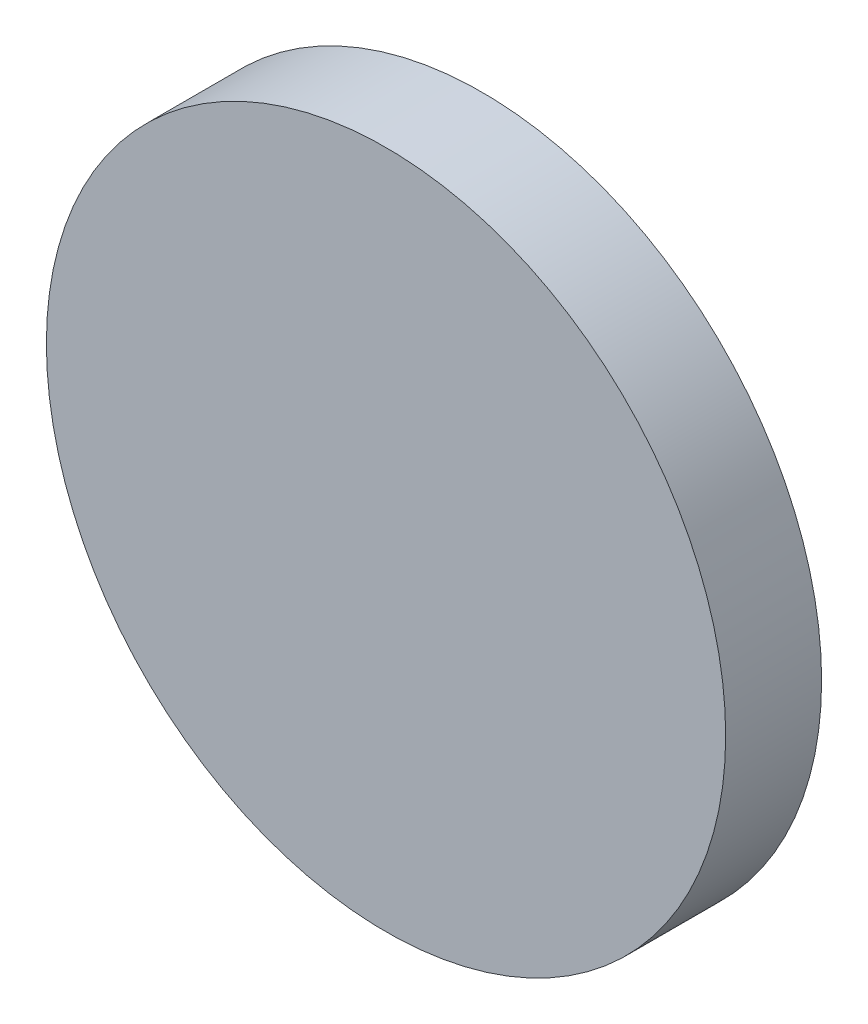
ISO-10303-21;
HEADER;
FILE_DESCRIPTION(('STEP AP214'),'2;1');
FILE_NAME('part.step','',(''),(''),'','','');
FILE_SCHEMA(('AUTOMOTIVE_DESIGN { 1 0 10303 214 1 1 1 1 }'));
ENDSEC;
DATA;
#1=APPLICATION_CONTEXT('core data for automotive mechanical design processes');
#2=APPLICATION_PROTOCOL_DEFINITION('international standard','automotive_design',2000,#1);
#3=PRODUCT_CONTEXT('',#1,'mechanical');
#4=PRODUCT('Part','Part','',(#3));
#5=PRODUCT_RELATED_PRODUCT_CATEGORY('part','',(#4));
#6=PRODUCT_DEFINITION_FORMATION('','',#4);
#7=PRODUCT_DEFINITION_CONTEXT('part definition',#1,'design');
#8=PRODUCT_DEFINITION('design','',#6,#7);
#9=PRODUCT_DEFINITION_SHAPE('','',#8);
#10=(LENGTH_UNIT() NAMED_UNIT(*) SI_UNIT(.MILLI.,.METRE.));
#11=(NAMED_UNIT(*) PLANE_ANGLE_UNIT() SI_UNIT($,.RADIAN.));
#12=(NAMED_UNIT(*) SI_UNIT($,.STERADIAN.) SOLID_ANGLE_UNIT());
#13=UNCERTAINTY_MEASURE_WITH_UNIT(LENGTH_MEASURE(1.E-05),#10,'distance_accuracy_value','');
#14=(GEOMETRIC_REPRESENTATION_CONTEXT(3) GLOBAL_UNCERTAINTY_ASSIGNED_CONTEXT((#13)) GLOBAL_UNIT_ASSIGNED_CONTEXT((#10,
#11,#12)) REPRESENTATION_CONTEXT('',''));
#15=CARTESIAN_POINT('',(0.,0.,0.));
#16=DIRECTION('',(0.,0.,1.));
#17=DIRECTION('',(1.,0.,0.));
#18=AXIS2_PLACEMENT_3D('',#15,#16,#17);
#19=CARTESIAN_POINT('',(0.,0.,1.));
#20=DIRECTION('',(0.,0.,-1.));
#21=DIRECTION('',(-1.,0.,0.));
#22=AXIS2_PLACEMENT_3D('',#19,#20,#21);
#23=CYLINDRICAL_SURFACE('',#22,3.54);
#24=CARTESIAN_POINT('',(0.,0.,1.));
#25=DIRECTION('',(0.,0.,1.));
#26=DIRECTION('',(1.,0.,0.));
#27=AXIS2_PLACEMENT_3D('',#24,#25,#26);
#28=CIRCLE('',#27,3.54);
#29=CARTESIAN_POINT('',(3.54,0.,1.));
#30=VERTEX_POINT('',#29);
#31=EDGE_CURVE('E10',#30,#30,#28,.T.);
#32=ORIENTED_EDGE('',*,*,#31,.F.);
#33=EDGE_LOOP('',(#32));
#34=FACE_BOUND('',#33,.T.);
#35=CARTESIAN_POINT('',(0.,0.,0.));
#36=DIRECTION('',(0.,0.,1.));
#37=DIRECTION('',(1.,0.,0.));
#38=AXIS2_PLACEMENT_3D('',#35,#36,#37);
#39=CIRCLE('',#38,3.54);
#40=CARTESIAN_POINT('',(3.54,0.,0.));
#41=VERTEX_POINT('',#40);
#42=EDGE_CURVE('E37',#41,#41,#39,.T.);
#43=ORIENTED_EDGE('',*,*,#42,.T.);
#44=EDGE_LOOP('',(#43));
#45=FACE_BOUND('',#44,.T.);
#46=ADVANCED_FACE('F34',(#34,#45),#23,.T.);
#47=CARTESIAN_POINT('',(0.,0.,1.));
#48=DIRECTION('',(0.,0.,1.));
#49=DIRECTION('',(1.,0.,0.));
#50=AXIS2_PLACEMENT_3D('',#47,#48,#49);
#51=PLANE('',#50);
#52=ORIENTED_EDGE('',*,*,#31,.T.);
#53=EDGE_LOOP('',(#52));
#54=FACE_BOUND('',#53,.T.);
#55=ADVANCED_FACE('F49',(#54),#51,.T.);
#56=CARTESIAN_POINT('',(0.,0.,0.));
#57=DIRECTION('',(0.,0.,1.));
#58=DIRECTION('',(1.,0.,0.));
#59=AXIS2_PLACEMENT_3D('',#56,#57,#58);
#60=PLANE('',#59);
#61=ORIENTED_EDGE('',*,*,#42,.F.);
#62=EDGE_LOOP('',(#61));
#63=FACE_BOUND('',#62,.T.);
#64=ADVANCED_FACE('F47',(#63),#60,.F.);
#65=CLOSED_SHELL('',(#46,#55,#64));
#66=MANIFOLD_SOLID_BREP('B2',#65);
#67=ADVANCED_BREP_SHAPE_REPRESENTATION('',(#18,#66),#14);
#68=SHAPE_DEFINITION_REPRESENTATION(#9,#67);
ENDSEC;
END-ISO-10303-21;
